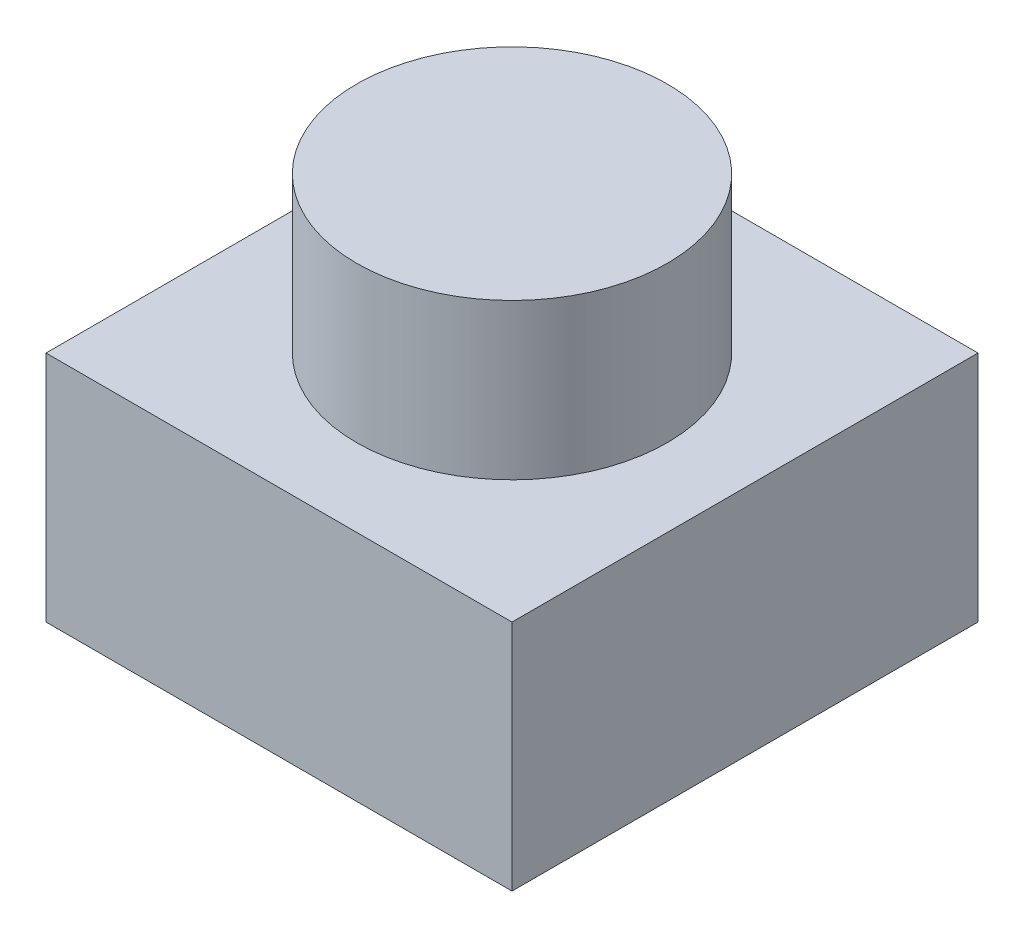
ISO-10303-21;
HEADER;
FILE_DESCRIPTION(('STEP AP214'),'2;1');
FILE_NAME('part.step','',(''),(''),'','','');
FILE_SCHEMA(('AUTOMOTIVE_DESIGN { 1 0 10303 214 1 1 1 1 }'));
ENDSEC;
DATA;
#1=APPLICATION_CONTEXT('core data for automotive mechanical design processes');
#2=APPLICATION_PROTOCOL_DEFINITION('international standard','automotive_design',2000,#1);
#3=PRODUCT_CONTEXT('',#1,'mechanical');
#4=PRODUCT('Part','Part','',(#3));
#5=PRODUCT_RELATED_PRODUCT_CATEGORY('part','',(#4));
#6=PRODUCT_DEFINITION_FORMATION('','',#4);
#7=PRODUCT_DEFINITION_CONTEXT('part definition',#1,'design');
#8=PRODUCT_DEFINITION('design','',#6,#7);
#9=PRODUCT_DEFINITION_SHAPE('','',#8);
#10=(LENGTH_UNIT() NAMED_UNIT(*) SI_UNIT(.MILLI.,.METRE.));
#11=(NAMED_UNIT(*) PLANE_ANGLE_UNIT() SI_UNIT($,.RADIAN.));
#12=(NAMED_UNIT(*) SI_UNIT($,.STERADIAN.) SOLID_ANGLE_UNIT());
#13=UNCERTAINTY_MEASURE_WITH_UNIT(LENGTH_MEASURE(1.E-05),#10,'distance_accuracy_value','');
#14=(GEOMETRIC_REPRESENTATION_CONTEXT(3) GLOBAL_UNCERTAINTY_ASSIGNED_CONTEXT((#13)) GLOBAL_UNIT_ASSIGNED_CONTEXT((#10,
#11,#12)) REPRESENTATION_CONTEXT('',''));
#15=CARTESIAN_POINT('',(0.,0.,0.));
#16=DIRECTION('',(0.,0.,1.));
#17=DIRECTION('',(1.,0.,0.));
#18=AXIS2_PLACEMENT_3D('',#15,#16,#17);
#19=CARTESIAN_POINT('',(3.,3.,3.));
#20=DIRECTION('',(-1.,0.,0.));
#21=DIRECTION('',(0.,0.,1.));
#22=AXIS2_PLACEMENT_3D('',#19,#20,#21);
#23=PLANE('',#22);
#24=DIRECTION('',(0.,0.,-1.));
#25=VECTOR('',#24,1.);
#26=CARTESIAN_POINT('',(3.,0.,3.));
#27=LINE('',#26,#25);
#28=CARTESIAN_POINT('',(3.,0.,3.));
#29=VERTEX_POINT('',#28);
#30=CARTESIAN_POINT('',(3.,0.,-3.));
#31=VERTEX_POINT('',#30);
#32=EDGE_CURVE('E112',#29,#31,#27,.T.);
#33=ORIENTED_EDGE('',*,*,#32,.T.);
#34=DIRECTION('',(0.,-1.,0.));
#35=VECTOR('',#34,1.);
#36=CARTESIAN_POINT('',(3.,3.,-3.));
#37=LINE('',#36,#35);
#38=CARTESIAN_POINT('',(3.,3.,-3.));
#39=VERTEX_POINT('',#38);
#40=EDGE_CURVE('E44',#39,#31,#37,.T.);
#41=ORIENTED_EDGE('',*,*,#40,.F.);
#42=DIRECTION('',(0.,0.,-1.));
#43=VECTOR('',#42,1.);
#44=CARTESIAN_POINT('',(3.,3.,3.));
#45=LINE('',#44,#43);
#46=CARTESIAN_POINT('',(3.,3.,3.));
#47=VERTEX_POINT('',#46);
#48=EDGE_CURVE('E95',#47,#39,#45,.T.);
#49=ORIENTED_EDGE('',*,*,#48,.F.);
#50=DIRECTION('',(0.,-1.,0.));
#51=VECTOR('',#50,1.);
#52=CARTESIAN_POINT('',(3.,3.,3.));
#53=LINE('',#52,#51);
#54=EDGE_CURVE('E108',#47,#29,#53,.T.);
#55=ORIENTED_EDGE('',*,*,#54,.T.);
#56=EDGE_LOOP('',(#33,#41,#49,#55));
#57=FACE_BOUND('',#56,.T.);
#58=ADVANCED_FACE('F41',(#57),#23,.F.);
#59=CARTESIAN_POINT('',(-3.,3.,-3.));
#60=DIRECTION('',(0.,0.,1.));
#61=DIRECTION('',(1.,0.,0.));
#62=AXIS2_PLACEMENT_3D('',#59,#60,#61);
#63=PLANE('',#62);
#64=DIRECTION('',(-1.,0.,0.));
#65=VECTOR('',#64,1.);
#66=CARTESIAN_POINT('',(-3.,0.,-3.));
#67=LINE('',#66,#65);
#68=CARTESIAN_POINT('',(-3.,0.,-3.));
#69=VERTEX_POINT('',#68);
#70=EDGE_CURVE('E101',#31,#69,#67,.T.);
#71=ORIENTED_EDGE('',*,*,#70,.T.);
#72=DIRECTION('',(0.,-1.,0.));
#73=VECTOR('',#72,1.);
#74=CARTESIAN_POINT('',(-3.,3.,-3.));
#75=LINE('',#74,#73);
#76=CARTESIAN_POINT('',(-3.,3.,-3.));
#77=VERTEX_POINT('',#76);
#78=EDGE_CURVE('E99',#77,#69,#75,.T.);
#79=ORIENTED_EDGE('',*,*,#78,.F.);
#80=DIRECTION('',(-1.,0.,0.));
#81=VECTOR('',#80,1.);
#82=CARTESIAN_POINT('',(-3.,3.,-3.));
#83=LINE('',#82,#81);
#84=EDGE_CURVE('E90',#39,#77,#83,.T.);
#85=ORIENTED_EDGE('',*,*,#84,.F.);
#86=ORIENTED_EDGE('',*,*,#40,.T.);
#87=EDGE_LOOP('',(#71,#79,#85,#86));
#88=FACE_BOUND('',#87,.T.);
#89=ADVANCED_FACE('F100',(#88),#63,.F.);
#90=CARTESIAN_POINT('',(-3.,3.,3.));
#91=DIRECTION('',(1.,0.,0.));
#92=DIRECTION('',(0.,0.,-1.));
#93=AXIS2_PLACEMENT_3D('',#90,#91,#92);
#94=PLANE('',#93);
#95=DIRECTION('',(0.,0.,1.));
#96=VECTOR('',#95,1.);
#97=CARTESIAN_POINT('',(-3.,0.,3.));
#98=LINE('',#97,#96);
#99=CARTESIAN_POINT('',(-3.,0.,3.));
#100=VERTEX_POINT('',#99);
#101=EDGE_CURVE('E76',#69,#100,#98,.T.);
#102=ORIENTED_EDGE('',*,*,#101,.T.);
#103=DIRECTION('',(0.,-1.,0.));
#104=VECTOR('',#103,1.);
#105=CARTESIAN_POINT('',(-3.,3.,3.));
#106=LINE('',#105,#104);
#107=CARTESIAN_POINT('',(-3.,3.,3.));
#108=VERTEX_POINT('',#107);
#109=EDGE_CURVE('E103',#108,#100,#106,.T.);
#110=ORIENTED_EDGE('',*,*,#109,.F.);
#111=DIRECTION('',(0.,0.,1.));
#112=VECTOR('',#111,1.);
#113=CARTESIAN_POINT('',(-3.,3.,3.));
#114=LINE('',#113,#112);
#115=EDGE_CURVE('E93',#77,#108,#114,.T.);
#116=ORIENTED_EDGE('',*,*,#115,.F.);
#117=ORIENTED_EDGE('',*,*,#78,.T.);
#118=EDGE_LOOP('',(#102,#110,#116,#117));
#119=FACE_BOUND('',#118,.T.);
#120=ADVANCED_FACE('F104',(#119),#94,.F.);
#121=CARTESIAN_POINT('',(-3.,3.,3.));
#122=DIRECTION('',(0.,0.,-1.));
#123=DIRECTION('',(-1.,0.,0.));
#124=AXIS2_PLACEMENT_3D('',#121,#122,#123);
#125=PLANE('',#124);
#126=DIRECTION('',(1.,0.,0.));
#127=VECTOR('',#126,1.);
#128=CARTESIAN_POINT('',(-3.,0.,3.));
#129=LINE('',#128,#127);
#130=EDGE_CURVE('E82',#100,#29,#129,.T.);
#131=ORIENTED_EDGE('',*,*,#130,.T.);
#132=ORIENTED_EDGE('',*,*,#54,.F.);
#133=DIRECTION('',(1.,0.,0.));
#134=VECTOR('',#133,1.);
#135=CARTESIAN_POINT('',(-3.,3.,3.));
#136=LINE('',#135,#134);
#137=EDGE_CURVE('E59',#108,#47,#136,.T.);
#138=ORIENTED_EDGE('',*,*,#137,.F.);
#139=ORIENTED_EDGE('',*,*,#109,.T.);
#140=EDGE_LOOP('',(#131,#132,#138,#139));
#141=FACE_BOUND('',#140,.T.);
#142=ADVANCED_FACE('F126',(#141),#125,.F.);
#143=CARTESIAN_POINT('',(0.,3.,0.));
#144=DIRECTION('',(0.,-1.,0.));
#145=DIRECTION('',(0.,0.,-1.));
#146=AXIS2_PLACEMENT_3D('',#143,#144,#145);
#147=PLANE('',#146);
#148=CARTESIAN_POINT('',(0.,3.,0.));
#149=DIRECTION('',(0.,1.,0.));
#150=DIRECTION('',(0.,0.,1.));
#151=AXIS2_PLACEMENT_3D('',#148,#149,#150);
#152=CIRCLE('',#151,2.);
#153=CARTESIAN_POINT('',(0.,3.,2.));
#154=VERTEX_POINT('',#153);
#155=EDGE_CURVE('E11',#154,#154,#152,.T.);
#156=ORIENTED_EDGE('',*,*,#155,.F.);
#157=EDGE_LOOP('',(#156));
#158=FACE_BOUND('',#157,.T.);
#159=ORIENTED_EDGE('',*,*,#48,.T.);
#160=ORIENTED_EDGE('',*,*,#84,.T.);
#161=ORIENTED_EDGE('',*,*,#115,.T.);
#162=ORIENTED_EDGE('',*,*,#137,.T.);
#163=EDGE_LOOP('',(#159,#160,#161,#162));
#164=FACE_BOUND('',#163,.T.);
#165=ADVANCED_FACE('F91',(#158,#164),#147,.F.);
#166=CARTESIAN_POINT('',(0.,0.,0.));
#167=DIRECTION('',(0.,-1.,0.));
#168=DIRECTION('',(0.,0.,-1.));
#169=AXIS2_PLACEMENT_3D('',#166,#167,#168);
#170=PLANE('',#169);
#171=ORIENTED_EDGE('',*,*,#32,.F.);
#172=ORIENTED_EDGE('',*,*,#130,.F.);
#173=ORIENTED_EDGE('',*,*,#101,.F.);
#174=ORIENTED_EDGE('',*,*,#70,.F.);
#175=EDGE_LOOP('',(#171,#172,#173,#174));
#176=FACE_BOUND('',#175,.T.);
#177=ADVANCED_FACE('F129',(#176),#170,.T.);
#178=CARTESIAN_POINT('',(0.,5.,0.));
#179=DIRECTION('',(0.,-1.,0.));
#180=DIRECTION('',(0.,0.,-1.));
#181=AXIS2_PLACEMENT_3D('',#178,#179,#180);
#182=CYLINDRICAL_SURFACE('',#181,2.);
#183=CARTESIAN_POINT('',(0.,5.,0.));
#184=DIRECTION('',(0.,1.,0.));
#185=DIRECTION('',(0.,0.,1.));
#186=AXIS2_PLACEMENT_3D('',#183,#184,#185);
#187=CIRCLE('',#186,2.);
#188=CARTESIAN_POINT('',(0.,5.,2.));
#189=VERTEX_POINT('',#188);
#190=EDGE_CURVE('E116',#189,#189,#187,.T.);
#191=ORIENTED_EDGE('',*,*,#190,.F.);
#192=EDGE_LOOP('',(#191));
#193=FACE_BOUND('',#192,.T.);
#194=ORIENTED_EDGE('',*,*,#155,.T.);
#195=EDGE_LOOP('',(#194));
#196=FACE_BOUND('',#195,.T.);
#197=ADVANCED_FACE('F139',(#193,#196),#182,.T.);
#198=CARTESIAN_POINT('',(0.,5.,0.));
#199=DIRECTION('',(0.,1.,0.));
#200=DIRECTION('',(0.,0.,1.));
#201=AXIS2_PLACEMENT_3D('',#198,#199,#200);
#202=PLANE('',#201);
#203=ORIENTED_EDGE('',*,*,#190,.T.);
#204=EDGE_LOOP('',(#203));
#205=FACE_BOUND('',#204,.T.);
#206=ADVANCED_FACE('F137',(#205),#202,.T.);
#207=CLOSED_SHELL('',(#58,#89,#120,#142,#165,#177,#197,#206));
#208=MANIFOLD_SOLID_BREP('B2',#207);
#209=ADVANCED_BREP_SHAPE_REPRESENTATION('',(#18,#208),#14);
#210=SHAPE_DEFINITION_REPRESENTATION(#9,#209);
ENDSEC;
END-ISO-10303-21;
